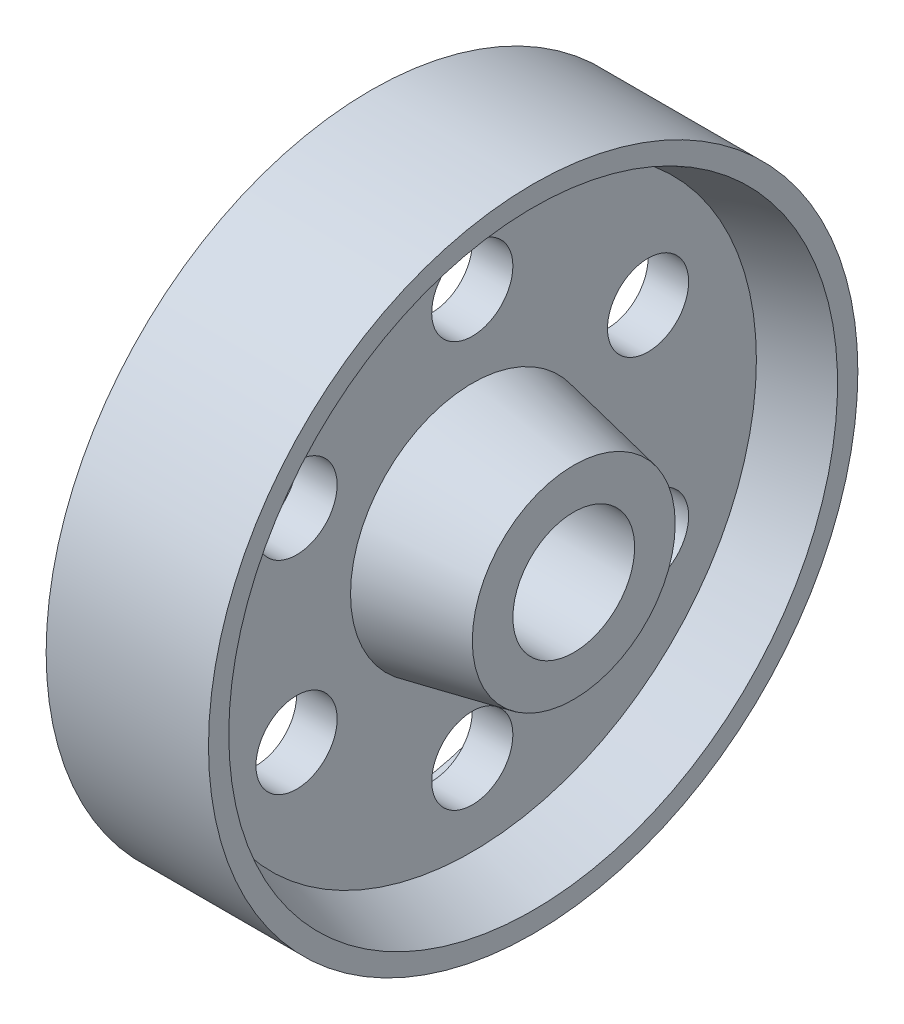
ISO-10303-21;
HEADER;
FILE_DESCRIPTION(('STEP AP214'),'2;1');
FILE_NAME('part.step','',(''),(''),'','','');
FILE_SCHEMA(('AUTOMOTIVE_DESIGN { 1 0 10303 214 1 1 1 1 }'));
ENDSEC;
DATA;
#1=APPLICATION_CONTEXT('core data for automotive mechanical design processes');
#2=APPLICATION_PROTOCOL_DEFINITION('international standard','automotive_design',2000,#1);
#3=PRODUCT_CONTEXT('',#1,'mechanical');
#4=PRODUCT('Part','Part','',(#3));
#5=PRODUCT_RELATED_PRODUCT_CATEGORY('part','',(#4));
#6=PRODUCT_DEFINITION_FORMATION('','',#4);
#7=PRODUCT_DEFINITION_CONTEXT('part definition',#1,'design');
#8=PRODUCT_DEFINITION('design','',#6,#7);
#9=PRODUCT_DEFINITION_SHAPE('','',#8);
#10=(LENGTH_UNIT() NAMED_UNIT(*) SI_UNIT(.MILLI.,.METRE.));
#11=(NAMED_UNIT(*) PLANE_ANGLE_UNIT() SI_UNIT($,.RADIAN.));
#12=(NAMED_UNIT(*) SI_UNIT($,.STERADIAN.) SOLID_ANGLE_UNIT());
#13=UNCERTAINTY_MEASURE_WITH_UNIT(LENGTH_MEASURE(1.E-05),#10,'distance_accuracy_value','');
#14=(GEOMETRIC_REPRESENTATION_CONTEXT(3) GLOBAL_UNCERTAINTY_ASSIGNED_CONTEXT((#13)) GLOBAL_UNIT_ASSIGNED_CONTEXT((#10,
#11,#12)) REPRESENTATION_CONTEXT('',''));
#15=CARTESIAN_POINT('',(0.,0.,0.));
#16=DIRECTION('',(0.,0.,1.));
#17=DIRECTION('',(1.,0.,0.));
#18=AXIS2_PLACEMENT_3D('',#15,#16,#17);
#19=CARTESIAN_POINT('',(0.,0.,0.));
#20=DIRECTION('',(-1.,0.,0.));
#21=DIRECTION('',(0.,0.,1.));
#22=AXIS2_PLACEMENT_3D('',#19,#20,#21);
#23=CYLINDRICAL_SURFACE('',#22,0.375);
#24=CARTESIAN_POINT('',(0.750000000000001,0.,0.));
#25=DIRECTION('',(-1.,0.,0.));
#26=DIRECTION('',(0.,0.,1.));
#27=AXIS2_PLACEMENT_3D('',#24,#25,#26);
#28=CIRCLE('',#27,0.375);
#29=CARTESIAN_POINT('',(0.750000000000001,0.,0.375));
#30=VERTEX_POINT('',#29);
#31=EDGE_CURVE('E10',#30,#30,#28,.T.);
#32=ORIENTED_EDGE('',*,*,#31,.F.);
#33=EDGE_LOOP('',(#32));
#34=FACE_BOUND('',#33,.T.);
#35=CARTESIAN_POINT('',(-0.750000000000001,0.,0.));
#36=DIRECTION('',(-1.,0.,0.));
#37=DIRECTION('',(0.,0.,1.));
#38=AXIS2_PLACEMENT_3D('',#35,#36,#37);
#39=CIRCLE('',#38,0.375);
#40=CARTESIAN_POINT('',(-0.750000000000001,0.,0.375));
#41=VERTEX_POINT('',#40);
#42=EDGE_CURVE('E90',#41,#41,#39,.T.);
#43=ORIENTED_EDGE('',*,*,#42,.T.);
#44=EDGE_LOOP('',(#43));
#45=FACE_BOUND('',#44,.T.);
#46=ADVANCED_FACE('F31',(#34,#45),#23,.F.);
#47=CARTESIAN_POINT('',(0.750000000000001,0.375,0.));
#48=DIRECTION('',(-1.,0.,0.));
#49=DIRECTION('',(0.,0.,1.));
#50=AXIS2_PLACEMENT_3D('',#47,#48,#49);
#51=PLANE('',#50);
#52=CARTESIAN_POINT('',(0.750000000000001,0.,0.));
#53=DIRECTION('',(-1.,0.,0.));
#54=DIRECTION('',(0.,0.,1.));
#55=AXIS2_PLACEMENT_3D('',#52,#53,#54);
#56=CIRCLE('',#55,0.625);
#57=CARTESIAN_POINT('',(0.750000000000001,0.,0.625));
#58=VERTEX_POINT('',#57);
#59=EDGE_CURVE('E38',#58,#58,#56,.T.);
#60=ORIENTED_EDGE('',*,*,#59,.F.);
#61=EDGE_LOOP('',(#60));
#62=FACE_BOUND('',#61,.T.);
#63=ORIENTED_EDGE('',*,*,#31,.T.);
#64=EDGE_LOOP('',(#63));
#65=FACE_BOUND('',#64,.T.);
#66=ADVANCED_FACE('F109',(#62,#65),#51,.F.);
#67=CARTESIAN_POINT('',(0.750000000000001,0.,0.));
#68=DIRECTION('',(-1.,0.,0.));
#69=DIRECTION('',(0.,0.,1.));
#70=AXIS2_PLACEMENT_3D('',#67,#68,#69);
#71=CONICAL_SURFACE('',#70,0.625,0.197395559849881);
#72=CARTESIAN_POINT('',(0.125,0.,0.));
#73=DIRECTION('',(-1.,0.,0.));
#74=DIRECTION('',(0.,0.,1.));
#75=AXIS2_PLACEMENT_3D('',#72,#73,#74);
#76=CIRCLE('',#75,0.75);
#77=CARTESIAN_POINT('',(0.125,0.,0.75));
#78=VERTEX_POINT('',#77);
#79=EDGE_CURVE('E43',#78,#78,#76,.T.);
#80=ORIENTED_EDGE('',*,*,#79,.F.);
#81=EDGE_LOOP('',(#80));
#82=FACE_BOUND('',#81,.T.);
#83=ORIENTED_EDGE('',*,*,#59,.T.);
#84=EDGE_LOOP('',(#83));
#85=FACE_BOUND('',#84,.T.);
#86=ADVANCED_FACE('F106',(#82,#85),#71,.T.);
#87=CARTESIAN_POINT('',(0.125,0.75,0.));
#88=DIRECTION('',(-1.,0.,0.));
#89=DIRECTION('',(0.,0.,1.));
#90=AXIS2_PLACEMENT_3D('',#87,#88,#89);
#91=PLANE('',#90);
#92=CARTESIAN_POINT('',(0.125,-0.625000000000001,-1.08253175473055));
#93=DIRECTION('',(1.,0.,0.));
#94=DIRECTION('',(0.,-0.86602540378444,-0.499999999999998));
#95=AXIS2_PLACEMENT_3D('',#92,#93,#94);
#96=CIRCLE('',#95,0.25);
#97=CARTESIAN_POINT('',(0.125,-0.841506350946111,-1.20753175473055));
#98=VERTEX_POINT('',#97);
#99=EDGE_CURVE('E56',#98,#98,#96,.T.);
#100=ORIENTED_EDGE('',*,*,#99,.F.);
#101=EDGE_LOOP('',(#100));
#102=FACE_BOUND('',#101,.T.);
#103=CARTESIAN_POINT('',(0.125,-1.25,0.));
#104=DIRECTION('',(1.,0.,0.));
#105=DIRECTION('',(0.,-0.866025403784436,0.500000000000004));
#106=AXIS2_PLACEMENT_3D('',#103,#104,#105);
#107=CIRCLE('',#106,0.25);
#108=CARTESIAN_POINT('',(0.125,-1.46650635094611,0.125000000000005));
#109=VERTEX_POINT('',#108);
#110=EDGE_CURVE('E180',#109,#109,#107,.T.);
#111=ORIENTED_EDGE('',*,*,#110,.F.);
#112=EDGE_LOOP('',(#111));
#113=FACE_BOUND('',#112,.T.);
#114=CARTESIAN_POINT('',(0.125,-0.625000000000002,1.08253175473055));
#115=DIRECTION('',(1.,0.,0.));
#116=DIRECTION('',(0.,0.,1.));
#117=AXIS2_PLACEMENT_3D('',#114,#115,#116);
#118=CIRCLE('',#117,0.25);
#119=CARTESIAN_POINT('',(0.125,-0.625000000000002,1.33253175473055));
#120=VERTEX_POINT('',#119);
#121=EDGE_CURVE('E183',#120,#120,#118,.T.);
#122=ORIENTED_EDGE('',*,*,#121,.F.);
#123=EDGE_LOOP('',(#122));
#124=FACE_BOUND('',#123,.T.);
#125=CARTESIAN_POINT('',(0.125,0.625000000000009,1.08253175473054));
#126=DIRECTION('',(1.,0.,0.));
#127=DIRECTION('',(0.,0.866025403784443,0.499999999999992));
#128=AXIS2_PLACEMENT_3D('',#125,#126,#127);
#129=CIRCLE('',#128,0.25);
#130=CARTESIAN_POINT('',(0.125,0.841506350946119,1.20753175473054));
#131=VERTEX_POINT('',#130);
#132=EDGE_CURVE('E187',#131,#131,#129,.T.);
#133=ORIENTED_EDGE('',*,*,#132,.F.);
#134=EDGE_LOOP('',(#133));
#135=FACE_BOUND('',#134,.T.);
#136=CARTESIAN_POINT('',(0.125,1.25,0.));
#137=DIRECTION('',(1.,0.,0.));
#138=DIRECTION('',(0.,0.866025403784433,-0.50000000000001));
#139=AXIS2_PLACEMENT_3D('',#136,#137,#138);
#140=CIRCLE('',#139,0.25);
#141=CARTESIAN_POINT('',(0.125,1.46650635094611,-0.125000000000015));
#142=VERTEX_POINT('',#141);
#143=EDGE_CURVE('E74',#142,#142,#140,.T.);
#144=ORIENTED_EDGE('',*,*,#143,.F.);
#145=EDGE_LOOP('',(#144));
#146=FACE_BOUND('',#145,.T.);
#147=CARTESIAN_POINT('',(0.125,0.625000000000002,-1.08253175473055));
#148=DIRECTION('',(1.,0.,0.));
#149=DIRECTION('',(0.,0.,-1.));
#150=AXIS2_PLACEMENT_3D('',#147,#148,#149);
#151=CIRCLE('',#150,0.25);
#152=CARTESIAN_POINT('',(0.125,0.625000000000002,-1.33253175473055));
#153=VERTEX_POINT('',#152);
#154=EDGE_CURVE('E51',#153,#153,#151,.T.);
#155=ORIENTED_EDGE('',*,*,#154,.F.);
#156=EDGE_LOOP('',(#155));
#157=FACE_BOUND('',#156,.T.);
#158=CARTESIAN_POINT('',(0.125,0.,0.));
#159=DIRECTION('',(-1.,0.,0.));
#160=DIRECTION('',(0.,0.,1.));
#161=AXIS2_PLACEMENT_3D('',#158,#159,#160);
#162=CIRCLE('',#161,1.75);
#163=CARTESIAN_POINT('',(0.125,0.,1.75));
#164=VERTEX_POINT('',#163);
#165=EDGE_CURVE('E99',#164,#164,#162,.T.);
#166=ORIENTED_EDGE('',*,*,#165,.F.);
#167=EDGE_LOOP('',(#166));
#168=FACE_BOUND('',#167,.T.);
#169=ORIENTED_EDGE('',*,*,#79,.T.);
#170=EDGE_LOOP('',(#169));
#171=FACE_BOUND('',#170,.T.);
#172=ADVANCED_FACE('F104',(#102,#113,#124,#135,#146,#157,#168,#171),#91,.F.);
#173=CARTESIAN_POINT('',(0.125,0.,0.));
#174=DIRECTION('',(1.,0.,0.));
#175=DIRECTION('',(0.,0.,-1.));
#176=AXIS2_PLACEMENT_3D('',#173,#174,#175);
#177=CONICAL_SURFACE('',#176,1.75,0.321750554396642);
#178=CARTESIAN_POINT('',(0.5,0.,0.));
#179=DIRECTION('',(-1.,0.,0.));
#180=DIRECTION('',(0.,0.,1.));
#181=AXIS2_PLACEMENT_3D('',#178,#179,#180);
#182=CIRCLE('',#181,1.875);
#183=CARTESIAN_POINT('',(0.5,0.,1.875));
#184=VERTEX_POINT('',#183);
#185=EDGE_CURVE('E96',#184,#184,#182,.T.);
#186=ORIENTED_EDGE('',*,*,#185,.F.);
#187=EDGE_LOOP('',(#186));
#188=FACE_BOUND('',#187,.T.);
#189=ORIENTED_EDGE('',*,*,#165,.T.);
#190=EDGE_LOOP('',(#189));
#191=FACE_BOUND('',#190,.T.);
#192=ADVANCED_FACE('F121',(#188,#191),#177,.F.);
#193=CARTESIAN_POINT('',(0.5,1.875,0.));
#194=DIRECTION('',(-1.,0.,0.));
#195=DIRECTION('',(0.,0.,1.));
#196=AXIS2_PLACEMENT_3D('',#193,#194,#195);
#197=PLANE('',#196);
#198=CARTESIAN_POINT('',(0.5,0.,0.));
#199=DIRECTION('',(-1.,0.,0.));
#200=DIRECTION('',(0.,0.,1.));
#201=AXIS2_PLACEMENT_3D('',#198,#199,#200);
#202=CIRCLE('',#201,2.);
#203=CARTESIAN_POINT('',(0.5,0.,2.));
#204=VERTEX_POINT('',#203);
#205=EDGE_CURVE('E93',#204,#204,#202,.T.);
#206=ORIENTED_EDGE('',*,*,#205,.F.);
#207=EDGE_LOOP('',(#206));
#208=FACE_BOUND('',#207,.T.);
#209=ORIENTED_EDGE('',*,*,#185,.T.);
#210=EDGE_LOOP('',(#209));
#211=FACE_BOUND('',#210,.T.);
#212=ADVANCED_FACE('F125',(#208,#211),#197,.F.);
#213=CARTESIAN_POINT('',(0.,0.,0.));
#214=DIRECTION('',(-1.,0.,0.));
#215=DIRECTION('',(0.,0.,1.));
#216=AXIS2_PLACEMENT_3D('',#213,#214,#215);
#217=CYLINDRICAL_SURFACE('',#216,2.);
#218=ORIENTED_EDGE('',*,*,#205,.T.);
#219=EDGE_LOOP('',(#218));
#220=FACE_BOUND('',#219,.T.);
#221=CARTESIAN_POINT('',(-0.5,0.,0.));
#222=DIRECTION('',(-1.,0.,0.));
#223=DIRECTION('',(0.,0.,1.));
#224=AXIS2_PLACEMENT_3D('',#221,#222,#223);
#225=CIRCLE('',#224,2.);
#226=CARTESIAN_POINT('',(-0.5,0.,2.));
#227=VERTEX_POINT('',#226);
#228=EDGE_CURVE('E50',#227,#227,#225,.T.);
#229=ORIENTED_EDGE('',*,*,#228,.F.);
#230=EDGE_LOOP('',(#229));
#231=FACE_BOUND('',#230,.T.);
#232=ADVANCED_FACE('F129',(#220,#231),#217,.T.);
#233=CARTESIAN_POINT('',(-0.750000000000001,0.375,0.));
#234=DIRECTION('',(1.,0.,0.));
#235=DIRECTION('',(0.,0.,1.));
#236=AXIS2_PLACEMENT_3D('',#233,#234,#235);
#237=PLANE('',#236);
#238=CARTESIAN_POINT('',(-0.750000000000001,0.,0.));
#239=DIRECTION('',(-1.,0.,0.));
#240=DIRECTION('',(0.,0.,1.));
#241=AXIS2_PLACEMENT_3D('',#238,#239,#240);
#242=CIRCLE('',#241,0.625);
#243=CARTESIAN_POINT('',(-0.750000000000001,0.,0.625));
#244=VERTEX_POINT('',#243);
#245=EDGE_CURVE('E87',#244,#244,#242,.T.);
#246=ORIENTED_EDGE('',*,*,#245,.T.);
#247=EDGE_LOOP('',(#246));
#248=FACE_BOUND('',#247,.T.);
#249=ORIENTED_EDGE('',*,*,#42,.F.);
#250=EDGE_LOOP('',(#249));
#251=FACE_BOUND('',#250,.T.);
#252=ADVANCED_FACE('F133',(#248,#251),#237,.F.);
#253=CARTESIAN_POINT('',(-0.750000000000001,0.,0.));
#254=DIRECTION('',(1.,0.,0.));
#255=DIRECTION('',(0.,0.,1.));
#256=AXIS2_PLACEMENT_3D('',#253,#254,#255);
#257=CONICAL_SURFACE('',#256,0.625,0.197395559849881);
#258=CARTESIAN_POINT('',(-0.125,0.,0.));
#259=DIRECTION('',(-1.,0.,0.));
#260=DIRECTION('',(0.,0.,1.));
#261=AXIS2_PLACEMENT_3D('',#258,#259,#260);
#262=CIRCLE('',#261,0.75);
#263=CARTESIAN_POINT('',(-0.125,0.,0.75));
#264=VERTEX_POINT('',#263);
#265=EDGE_CURVE('E84',#264,#264,#262,.T.);
#266=ORIENTED_EDGE('',*,*,#265,.T.);
#267=EDGE_LOOP('',(#266));
#268=FACE_BOUND('',#267,.T.);
#269=ORIENTED_EDGE('',*,*,#245,.F.);
#270=EDGE_LOOP('',(#269));
#271=FACE_BOUND('',#270,.T.);
#272=ADVANCED_FACE('F137',(#268,#271),#257,.T.);
#273=CARTESIAN_POINT('',(-0.125,0.75,0.));
#274=DIRECTION('',(1.,0.,0.));
#275=DIRECTION('',(0.,0.,1.));
#276=AXIS2_PLACEMENT_3D('',#273,#274,#275);
#277=PLANE('',#276);
#278=CARTESIAN_POINT('',(-0.125,-0.625000000000001,-1.08253175473055));
#279=DIRECTION('',(1.,0.,0.));
#280=DIRECTION('',(0.,0.,-1.));
#281=AXIS2_PLACEMENT_3D('',#278,#279,#280);
#282=CIRCLE('',#281,0.25);
#283=CARTESIAN_POINT('',(-0.125,-0.625000000000001,-1.33253175473055));
#284=VERTEX_POINT('',#283);
#285=EDGE_CURVE('E34',#284,#284,#282,.T.);
#286=ORIENTED_EDGE('',*,*,#285,.T.);
#287=EDGE_LOOP('',(#286));
#288=FACE_BOUND('',#287,.T.);
#289=CARTESIAN_POINT('',(-0.125,-1.25,0.));
#290=DIRECTION('',(1.,0.,0.));
#291=DIRECTION('',(0.,0.,-1.));
#292=AXIS2_PLACEMENT_3D('',#289,#290,#291);
#293=CIRCLE('',#292,0.25);
#294=CARTESIAN_POINT('',(-0.125,-1.25,-0.249999999999996));
#295=VERTEX_POINT('',#294);
#296=EDGE_CURVE('E61',#295,#295,#293,.T.);
#297=ORIENTED_EDGE('',*,*,#296,.T.);
#298=EDGE_LOOP('',(#297));
#299=FACE_BOUND('',#298,.T.);
#300=CARTESIAN_POINT('',(-0.125,-0.625000000000002,1.08253175473055));
#301=DIRECTION('',(1.,0.,0.));
#302=DIRECTION('',(0.,0.,-1.));
#303=AXIS2_PLACEMENT_3D('',#300,#301,#302);
#304=CIRCLE('',#303,0.25);
#305=CARTESIAN_POINT('',(-0.125,-0.625000000000002,0.832531754730548));
#306=VERTEX_POINT('',#305);
#307=EDGE_CURVE('E59',#306,#306,#304,.T.);
#308=ORIENTED_EDGE('',*,*,#307,.T.);
#309=EDGE_LOOP('',(#308));
#310=FACE_BOUND('',#309,.T.);
#311=CARTESIAN_POINT('',(-0.125,0.625000000000009,1.08253175473054));
#312=DIRECTION('',(1.,0.,0.));
#313=DIRECTION('',(0.,0.,-1.));
#314=AXIS2_PLACEMENT_3D('',#311,#312,#313);
#315=CIRCLE('',#314,0.25);
#316=CARTESIAN_POINT('',(-0.125,0.625000000000009,0.832531754730544));
#317=VERTEX_POINT('',#316);
#318=EDGE_CURVE('E55',#317,#317,#315,.T.);
#319=ORIENTED_EDGE('',*,*,#318,.T.);
#320=EDGE_LOOP('',(#319));
#321=FACE_BOUND('',#320,.T.);
#322=CARTESIAN_POINT('',(-0.125,1.25,0.));
#323=DIRECTION('',(1.,0.,0.));
#324=DIRECTION('',(0.,0.,-1.));
#325=AXIS2_PLACEMENT_3D('',#322,#323,#324);
#326=CIRCLE('',#325,0.25);
#327=CARTESIAN_POINT('',(-0.125,1.25,-0.250000000000013));
#328=VERTEX_POINT('',#327);
#329=EDGE_CURVE('E52',#328,#328,#326,.T.);
#330=ORIENTED_EDGE('',*,*,#329,.T.);
#331=EDGE_LOOP('',(#330));
#332=FACE_BOUND('',#331,.T.);
#333=CARTESIAN_POINT('',(-0.125,0.625000000000002,-1.08253175473055));
#334=DIRECTION('',(1.,0.,0.));
#335=DIRECTION('',(0.,0.,-1.));
#336=AXIS2_PLACEMENT_3D('',#333,#334,#335);
#337=CIRCLE('',#336,0.25);
#338=CARTESIAN_POINT('',(-0.125,0.625000000000002,-1.33253175473055));
#339=VERTEX_POINT('',#338);
#340=EDGE_CURVE('E47',#339,#339,#337,.T.);
#341=ORIENTED_EDGE('',*,*,#340,.T.);
#342=EDGE_LOOP('',(#341));
#343=FACE_BOUND('',#342,.T.);
#344=CARTESIAN_POINT('',(-0.125,0.,0.));
#345=DIRECTION('',(-1.,0.,0.));
#346=DIRECTION('',(0.,0.,1.));
#347=AXIS2_PLACEMENT_3D('',#344,#345,#346);
#348=CIRCLE('',#347,1.75);
#349=CARTESIAN_POINT('',(-0.125,0.,1.75));
#350=VERTEX_POINT('',#349);
#351=EDGE_CURVE('E81',#350,#350,#348,.T.);
#352=ORIENTED_EDGE('',*,*,#351,.T.);
#353=EDGE_LOOP('',(#352));
#354=FACE_BOUND('',#353,.T.);
#355=ORIENTED_EDGE('',*,*,#265,.F.);
#356=EDGE_LOOP('',(#355));
#357=FACE_BOUND('',#356,.T.);
#358=ADVANCED_FACE('F141',(#288,#299,#310,#321,#332,#343,#354,#357),#277,.F.);
#359=CARTESIAN_POINT('',(-0.125,0.,0.));
#360=DIRECTION('',(-1.,0.,0.));
#361=DIRECTION('',(0.,0.,-1.));
#362=AXIS2_PLACEMENT_3D('',#359,#360,#361);
#363=CONICAL_SURFACE('',#362,1.75,0.321750554396642);
#364=CARTESIAN_POINT('',(-0.5,0.,0.));
#365=DIRECTION('',(-1.,0.,0.));
#366=DIRECTION('',(0.,0.,1.));
#367=AXIS2_PLACEMENT_3D('',#364,#365,#366);
#368=CIRCLE('',#367,1.875);
#369=CARTESIAN_POINT('',(-0.5,0.,1.875));
#370=VERTEX_POINT('',#369);
#371=EDGE_CURVE('E78',#370,#370,#368,.T.);
#372=ORIENTED_EDGE('',*,*,#371,.T.);
#373=EDGE_LOOP('',(#372));
#374=FACE_BOUND('',#373,.T.);
#375=ORIENTED_EDGE('',*,*,#351,.F.);
#376=EDGE_LOOP('',(#375));
#377=FACE_BOUND('',#376,.T.);
#378=ADVANCED_FACE('F145',(#374,#377),#363,.F.);
#379=CARTESIAN_POINT('',(-0.5,1.875,0.));
#380=DIRECTION('',(1.,0.,0.));
#381=DIRECTION('',(0.,0.,1.));
#382=AXIS2_PLACEMENT_3D('',#379,#380,#381);
#383=PLANE('',#382);
#384=ORIENTED_EDGE('',*,*,#228,.T.);
#385=EDGE_LOOP('',(#384));
#386=FACE_BOUND('',#385,.T.);
#387=ORIENTED_EDGE('',*,*,#371,.F.);
#388=EDGE_LOOP('',(#387));
#389=FACE_BOUND('',#388,.T.);
#390=ADVANCED_FACE('F148',(#386,#389),#383,.F.);
#391=CARTESIAN_POINT('',(-0.750000000000001,0.625000000000002,-1.08253175473055));
#392=DIRECTION('',(1.,0.,0.));
#393=DIRECTION('',(0.,0.,-1.));
#394=AXIS2_PLACEMENT_3D('',#391,#392,#393);
#395=CYLINDRICAL_SURFACE('',#394,0.25);
#396=ORIENTED_EDGE('',*,*,#154,.T.);
#397=EDGE_LOOP('',(#396));
#398=FACE_BOUND('',#397,.T.);
#399=ORIENTED_EDGE('',*,*,#340,.F.);
#400=EDGE_LOOP('',(#399));
#401=FACE_BOUND('',#400,.T.);
#402=ADVANCED_FACE('F152',(#398,#401),#395,.F.);
#403=CARTESIAN_POINT('',(-0.750000000000001,1.25,0.));
#404=DIRECTION('',(1.,0.,0.));
#405=DIRECTION('',(0.,0.,-1.));
#406=AXIS2_PLACEMENT_3D('',#403,#404,#405);
#407=CYLINDRICAL_SURFACE('',#406,0.25);
#408=ORIENTED_EDGE('',*,*,#143,.T.);
#409=EDGE_LOOP('',(#408));
#410=FACE_BOUND('',#409,.T.);
#411=ORIENTED_EDGE('',*,*,#329,.F.);
#412=EDGE_LOOP('',(#411));
#413=FACE_BOUND('',#412,.T.);
#414=ADVANCED_FACE('F156',(#410,#413),#407,.F.);
#415=CARTESIAN_POINT('',(-0.750000000000001,0.625000000000009,1.08253175473054));
#416=DIRECTION('',(1.,0.,0.));
#417=DIRECTION('',(0.,0.,-1.));
#418=AXIS2_PLACEMENT_3D('',#415,#416,#417);
#419=CYLINDRICAL_SURFACE('',#418,0.25);
#420=ORIENTED_EDGE('',*,*,#132,.T.);
#421=EDGE_LOOP('',(#420));
#422=FACE_BOUND('',#421,.T.);
#423=ORIENTED_EDGE('',*,*,#318,.F.);
#424=EDGE_LOOP('',(#423));
#425=FACE_BOUND('',#424,.T.);
#426=ADVANCED_FACE('F159',(#422,#425),#419,.F.);
#427=CARTESIAN_POINT('',(-0.750000000000001,-0.625000000000002,1.08253175473055));
#428=DIRECTION('',(1.,0.,0.));
#429=DIRECTION('',(0.,0.,-1.));
#430=AXIS2_PLACEMENT_3D('',#427,#428,#429);
#431=CYLINDRICAL_SURFACE('',#430,0.25);
#432=ORIENTED_EDGE('',*,*,#121,.T.);
#433=EDGE_LOOP('',(#432));
#434=FACE_BOUND('',#433,.T.);
#435=ORIENTED_EDGE('',*,*,#307,.F.);
#436=EDGE_LOOP('',(#435));
#437=FACE_BOUND('',#436,.T.);
#438=ADVANCED_FACE('F163',(#434,#437),#431,.F.);
#439=CARTESIAN_POINT('',(-0.750000000000001,-1.25,0.));
#440=DIRECTION('',(1.,0.,0.));
#441=DIRECTION('',(0.,0.,-1.));
#442=AXIS2_PLACEMENT_3D('',#439,#440,#441);
#443=CYLINDRICAL_SURFACE('',#442,0.25);
#444=ORIENTED_EDGE('',*,*,#110,.T.);
#445=EDGE_LOOP('',(#444));
#446=FACE_BOUND('',#445,.T.);
#447=ORIENTED_EDGE('',*,*,#296,.F.);
#448=EDGE_LOOP('',(#447));
#449=FACE_BOUND('',#448,.T.);
#450=ADVANCED_FACE('F167',(#446,#449),#443,.F.);
#451=CARTESIAN_POINT('',(-0.750000000000001,-0.625000000000001,-1.08253175473055));
#452=DIRECTION('',(1.,0.,0.));
#453=DIRECTION('',(0.,0.,-1.));
#454=AXIS2_PLACEMENT_3D('',#451,#452,#453);
#455=CYLINDRICAL_SURFACE('',#454,0.25);
#456=ORIENTED_EDGE('',*,*,#99,.T.);
#457=EDGE_LOOP('',(#456));
#458=FACE_BOUND('',#457,.T.);
#459=ORIENTED_EDGE('',*,*,#285,.F.);
#460=EDGE_LOOP('',(#459));
#461=FACE_BOUND('',#460,.T.);
#462=ADVANCED_FACE('F171',(#458,#461),#455,.F.);
#463=CLOSED_SHELL('',(#46,#66,#86,#172,#192,#212,#232,#252,#272,#358,#378,#390,#402,#414,#426,
#438,#450,#462));
#464=MANIFOLD_SOLID_BREP('B2',#463);
#465=ADVANCED_BREP_SHAPE_REPRESENTATION('',(#18,#464),#14);
#466=SHAPE_DEFINITION_REPRESENTATION(#9,#465);
ENDSEC;
END-ISO-10303-21;
